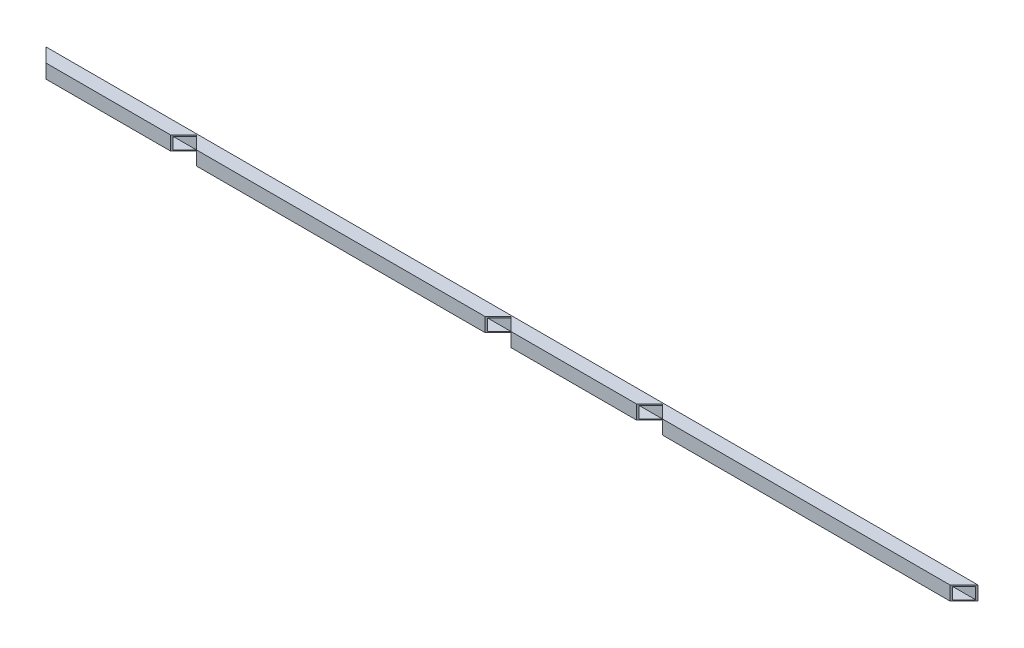
ISO-10303-21;
HEADER;
FILE_DESCRIPTION(('STEP AP214'),'2;1');
FILE_NAME('part.step','',(''),(''),'','','');
FILE_SCHEMA(('AUTOMOTIVE_DESIGN { 1 0 10303 214 1 1 1 1 }'));
ENDSEC;
DATA;
#1=APPLICATION_CONTEXT('core data for automotive mechanical design processes');
#2=APPLICATION_PROTOCOL_DEFINITION('international standard','automotive_design',2000,#1);
#3=PRODUCT_CONTEXT('',#1,'mechanical');
#4=PRODUCT('Part','Part','',(#3));
#5=PRODUCT_RELATED_PRODUCT_CATEGORY('part','',(#4));
#6=PRODUCT_DEFINITION_FORMATION('','',#4);
#7=PRODUCT_DEFINITION_CONTEXT('part definition',#1,'design');
#8=PRODUCT_DEFINITION('design','',#6,#7);
#9=PRODUCT_DEFINITION_SHAPE('','',#8);
#10=(LENGTH_UNIT() NAMED_UNIT(*) SI_UNIT(.MILLI.,.METRE.));
#11=(NAMED_UNIT(*) PLANE_ANGLE_UNIT() SI_UNIT($,.RADIAN.));
#12=(NAMED_UNIT(*) SI_UNIT($,.STERADIAN.) SOLID_ANGLE_UNIT());
#13=UNCERTAINTY_MEASURE_WITH_UNIT(LENGTH_MEASURE(1.E-05),#10,'distance_accuracy_value','');
#14=(GEOMETRIC_REPRESENTATION_CONTEXT(3) GLOBAL_UNCERTAINTY_ASSIGNED_CONTEXT((#13)) GLOBAL_UNIT_ASSIGNED_CONTEXT((#10,
#11,#12)) REPRESENTATION_CONTEXT('',''));
#15=CARTESIAN_POINT('',(0.,0.,0.));
#16=DIRECTION('',(0.,0.,1.));
#17=DIRECTION('',(1.,0.,0.));
#18=AXIS2_PLACEMENT_3D('',#15,#16,#17);
#19=CARTESIAN_POINT('',(-400.,-1.,-5.00000000000001));
#20=DIRECTION('',(0.,0.,-1.));
#21=DIRECTION('',(0.,1.,0.));
#22=AXIS2_PLACEMENT_3D('',#19,#20,#21);
#23=PLANE('',#22);
#24=DIRECTION('',(0.,-1.,0.));
#25=VECTOR('',#24,1.);
#26=CARTESIAN_POINT('',(130.,-1.00000000000005,-5.00000000000001));
#27=LINE('',#26,#25);
#28=CARTESIAN_POINT('',(130.,-1.,-5.));
#29=VERTEX_POINT('',#28);
#30=CARTESIAN_POINT('',(130.,-11.,-5.00000000000001));
#31=VERTEX_POINT('',#30);
#32=EDGE_CURVE('E11',#29,#31,#27,.T.);
#33=ORIENTED_EDGE('',*,*,#32,.F.);
#34=DIRECTION('',(1.,0.,0.));
#35=VECTOR('',#34,1.);
#36=CARTESIAN_POINT('',(-400.,-1.,-5.00000000000001));
#37=LINE('',#36,#35);
#38=CARTESIAN_POINT('',(0.,-1.,-5.));
#39=VERTEX_POINT('',#38);
#40=EDGE_CURVE('E293',#39,#29,#37,.T.);
#41=ORIENTED_EDGE('',*,*,#40,.F.);
#42=DIRECTION('',(0.,-1.,0.));
#43=VECTOR('',#42,1.);
#44=CARTESIAN_POINT('',(0.,-1.00000000000003,-5.00000000000001));
#45=LINE('',#44,#43);
#46=CARTESIAN_POINT('',(0.,-11.,-5.00000000000001));
#47=VERTEX_POINT('',#46);
#48=EDGE_CURVE('E45',#39,#47,#45,.T.);
#49=ORIENTED_EDGE('',*,*,#48,.T.);
#50=DIRECTION('',(1.,0.,0.));
#51=VECTOR('',#50,1.);
#52=CARTESIAN_POINT('',(-400.,-11.,-5.00000000000001));
#53=LINE('',#52,#51);
#54=EDGE_CURVE('E291',#47,#31,#53,.T.);
#55=ORIENTED_EDGE('',*,*,#54,.T.);
#56=EDGE_LOOP('',(#33,#41,#49,#55));
#57=FACE_BOUND('',#56,.T.);
#58=ADVANCED_FACE('F37',(#57),#23,.F.);
#59=ORIENTED_EDGE('',*,*,#48,.F.);
#60=CARTESIAN_POINT('',(-270.,-1.,-5.00000000000001));
#61=VERTEX_POINT('',#60);
#62=EDGE_CURVE('E487',#61,#39,#37,.T.);
#63=ORIENTED_EDGE('',*,*,#62,.F.);
#64=DIRECTION('',(0.,1.,0.));
#65=VECTOR('',#64,1.);
#66=CARTESIAN_POINT('',(-270.,-0.999999999999989,-5.00000000000001));
#67=LINE('',#66,#65);
#68=CARTESIAN_POINT('',(-270.,-11.,-5.00000000000001));
#69=VERTEX_POINT('',#68);
#70=EDGE_CURVE('E281',#69,#61,#67,.T.);
#71=ORIENTED_EDGE('',*,*,#70,.F.);
#72=EDGE_CURVE('E304',#69,#47,#53,.T.);
#73=ORIENTED_EDGE('',*,*,#72,.T.);
#74=EDGE_LOOP('',(#59,#63,#71,#73));
#75=FACE_BOUND('',#74,.T.);
#76=ADVANCED_FACE('F324',(#75),#23,.F.);
#77=CARTESIAN_POINT('',(399.,-1.,-5.));
#78=VERTEX_POINT('',#77);
#79=EDGE_CURVE('E343',#29,#78,#37,.T.);
#80=ORIENTED_EDGE('',*,*,#79,.F.);
#81=ORIENTED_EDGE('',*,*,#32,.T.);
#82=CARTESIAN_POINT('',(399.,-11.,-5.));
#83=VERTEX_POINT('',#82);
#84=EDGE_CURVE('E321',#31,#83,#53,.T.);
#85=ORIENTED_EDGE('',*,*,#84,.T.);
#86=DIRECTION('',(0.,1.,0.));
#87=VECTOR('',#86,1.);
#88=CARTESIAN_POINT('',(399.,-0.999999999999931,-5.00000000000001));
#89=LINE('',#88,#87);
#90=EDGE_CURVE('E412',#83,#78,#89,.T.);
#91=ORIENTED_EDGE('',*,*,#90,.T.);
#92=EDGE_LOOP('',(#80,#81,#85,#91));
#93=FACE_BOUND('',#92,.T.);
#94=ADVANCED_FACE('F518',(#93),#23,.F.);
#95=CARTESIAN_POINT('',(-400.,-11.,5.));
#96=DIRECTION('',(0.,-1.,0.));
#97=DIRECTION('',(0.,0.,-1.));
#98=AXIS2_PLACEMENT_3D('',#95,#96,#97);
#99=PLANE('',#98);
#100=DIRECTION('',(1.,0.,0.));
#101=VECTOR('',#100,1.);
#102=CARTESIAN_POINT('',(-400.,-11.,5.));
#103=LINE('',#102,#101);
#104=CARTESIAN_POINT('',(10.,-11.,5.));
#105=VERTEX_POINT('',#104);
#106=CARTESIAN_POINT('',(120.,-11.,5.));
#107=VERTEX_POINT('',#106);
#108=EDGE_CURVE('E336',#105,#107,#103,.T.);
#109=ORIENTED_EDGE('',*,*,#108,.T.);
#110=DIRECTION('',(0.707106781186546,0.,-0.707106781186549));
#111=VECTOR('',#110,1.);
#112=CARTESIAN_POINT('',(-139.999999999999,-11.,265.));
#113=LINE('',#112,#111);
#114=EDGE_CURVE('E319',#107,#31,#113,.T.);
#115=ORIENTED_EDGE('',*,*,#114,.T.);
#116=ORIENTED_EDGE('',*,*,#54,.F.);
#117=DIRECTION('',(0.707106781186548,0.,0.707106781186547));
#118=VECTOR('',#117,1.);
#119=CARTESIAN_POINT('',(-195.,-11.,-200.));
#120=LINE('',#119,#118);
#121=EDGE_CURVE('E317',#47,#105,#120,.T.);
#122=ORIENTED_EDGE('',*,*,#121,.T.);
#123=EDGE_LOOP('',(#109,#115,#116,#122));
#124=FACE_BOUND('',#123,.T.);
#125=ADVANCED_FACE('F316',(#124),#99,.F.);
#126=CARTESIAN_POINT('',(-260.,-11.,5.));
#127=VERTEX_POINT('',#126);
#128=CARTESIAN_POINT('',(-9.9999999999999,-11.,5.));
#129=VERTEX_POINT('',#128);
#130=EDGE_CURVE('E307',#127,#129,#103,.T.);
#131=ORIENTED_EDGE('',*,*,#130,.T.);
#132=DIRECTION('',(0.707106781186546,0.,-0.707106781186549));
#133=VECTOR('',#132,1.);
#134=CARTESIAN_POINT('',(-204.999999999999,-11.,200.));
#135=LINE('',#134,#133);
#136=EDGE_CURVE('E301',#129,#47,#135,.T.);
#137=ORIENTED_EDGE('',*,*,#136,.T.);
#138=ORIENTED_EDGE('',*,*,#72,.F.);
#139=DIRECTION('',(0.707106781186548,0.,0.707106781186547));
#140=VECTOR('',#139,1.);
#141=CARTESIAN_POINT('',(-330.,-11.,-65.));
#142=LINE('',#141,#140);
#143=EDGE_CURVE('E379',#69,#127,#142,.T.);
#144=ORIENTED_EDGE('',*,*,#143,.T.);
#145=EDGE_LOOP('',(#131,#137,#138,#144));
#146=FACE_BOUND('',#145,.T.);
#147=ADVANCED_FACE('F302',(#146),#99,.F.);
#148=ORIENTED_EDGE('',*,*,#84,.F.);
#149=DIRECTION('',(0.707106781186548,0.,0.707106781186547));
#150=VECTOR('',#149,1.);
#151=CARTESIAN_POINT('',(-130.,-11.,-265.));
#152=LINE('',#151,#150);
#153=CARTESIAN_POINT('',(140.,-11.,5.));
#154=VERTEX_POINT('',#153);
#155=EDGE_CURVE('E421',#31,#154,#152,.T.);
#156=ORIENTED_EDGE('',*,*,#155,.T.);
#157=CARTESIAN_POINT('',(389.,-11.,5.));
#158=VERTEX_POINT('',#157);
#159=EDGE_CURVE('E333',#154,#158,#103,.T.);
#160=ORIENTED_EDGE('',*,*,#159,.T.);
#161=DIRECTION('',(0.707106781186541,0.,-0.707106781186554));
#162=VECTOR('',#161,1.);
#163=CARTESIAN_POINT('',(-5.49999999999295,-11.,399.5));
#164=LINE('',#163,#162);
#165=EDGE_CURVE('E409',#158,#83,#164,.T.);
#166=ORIENTED_EDGE('',*,*,#165,.T.);
#167=EDGE_LOOP('',(#148,#156,#160,#166));
#168=FACE_BOUND('',#167,.T.);
#169=ADVANCED_FACE('F510',(#168),#99,.F.);
#170=CARTESIAN_POINT('',(-400.,-1.,5.));
#171=DIRECTION('',(0.,0.,1.));
#172=DIRECTION('',(0.,-1.,0.));
#173=AXIS2_PLACEMENT_3D('',#170,#171,#172);
#174=PLANE('',#173);
#175=DIRECTION('',(1.,0.,0.));
#176=VECTOR('',#175,1.);
#177=CARTESIAN_POINT('',(-400.,-1.,5.));
#178=LINE('',#177,#176);
#179=CARTESIAN_POINT('',(9.99999999999998,-1.,4.99999999999998));
#180=VERTEX_POINT('',#179);
#181=CARTESIAN_POINT('',(120.,-1.,4.99999999999995));
#182=VERTEX_POINT('',#181);
#183=EDGE_CURVE('E341',#180,#182,#178,.T.);
#184=ORIENTED_EDGE('',*,*,#183,.T.);
#185=DIRECTION('',(0.,-1.,0.));
#186=VECTOR('',#185,1.);
#187=CARTESIAN_POINT('',(120.,-0.999999999999955,5.));
#188=LINE('',#187,#186);
#189=EDGE_CURVE('E426',#182,#107,#188,.T.);
#190=ORIENTED_EDGE('',*,*,#189,.T.);
#191=ORIENTED_EDGE('',*,*,#108,.F.);
#192=DIRECTION('',(0.,1.,0.));
#193=VECTOR('',#192,1.);
#194=CARTESIAN_POINT('',(10.,-1.00000000000004,5.));
#195=LINE('',#194,#193);
#196=EDGE_CURVE('E387',#105,#180,#195,.T.);
#197=ORIENTED_EDGE('',*,*,#196,.T.);
#198=EDGE_LOOP('',(#184,#190,#191,#197));
#199=FACE_BOUND('',#198,.T.);
#200=ADVANCED_FACE('F481',(#199),#174,.F.);
#201=CARTESIAN_POINT('',(-260.,-1.,4.99999999999999));
#202=VERTEX_POINT('',#201);
#203=CARTESIAN_POINT('',(-9.99999999999984,-1.,5.));
#204=VERTEX_POINT('',#203);
#205=EDGE_CURVE('E498',#202,#204,#178,.T.);
#206=ORIENTED_EDGE('',*,*,#205,.T.);
#207=DIRECTION('',(0.,-1.,0.));
#208=VECTOR('',#207,1.);
#209=CARTESIAN_POINT('',(-9.9999999999999,-0.999999999999966,5.));
#210=LINE('',#209,#208);
#211=EDGE_CURVE('E310',#204,#129,#210,.T.);
#212=ORIENTED_EDGE('',*,*,#211,.T.);
#213=ORIENTED_EDGE('',*,*,#130,.F.);
#214=DIRECTION('',(0.,1.,0.));
#215=VECTOR('',#214,1.);
#216=CARTESIAN_POINT('',(-260.,-1.00000000000001,5.));
#217=LINE('',#216,#215);
#218=EDGE_CURVE('E375',#127,#202,#217,.T.);
#219=ORIENTED_EDGE('',*,*,#218,.T.);
#220=EDGE_LOOP('',(#206,#212,#213,#219));
#221=FACE_BOUND('',#220,.T.);
#222=ADVANCED_FACE('F501',(#221),#174,.F.);
#223=ORIENTED_EDGE('',*,*,#159,.F.);
#224=DIRECTION('',(0.,1.,0.));
#225=VECTOR('',#224,1.);
#226=CARTESIAN_POINT('',(140.,-1.00000000000005,5.));
#227=LINE('',#226,#225);
#228=CARTESIAN_POINT('',(140.,-1.,4.99999999999995));
#229=VERTEX_POINT('',#228);
#230=EDGE_CURVE('E418',#154,#229,#227,.T.);
#231=ORIENTED_EDGE('',*,*,#230,.T.);
#232=CARTESIAN_POINT('',(389.,-1.,4.99999999999997));
#233=VERTEX_POINT('',#232);
#234=EDGE_CURVE('E338',#229,#233,#178,.T.);
#235=ORIENTED_EDGE('',*,*,#234,.T.);
#236=DIRECTION('',(0.,-1.,0.));
#237=VECTOR('',#236,1.);
#238=CARTESIAN_POINT('',(389.,-0.999999999999931,5.));
#239=LINE('',#238,#237);
#240=EDGE_CURVE('E406',#233,#158,#239,.T.);
#241=ORIENTED_EDGE('',*,*,#240,.T.);
#242=EDGE_LOOP('',(#223,#231,#235,#241));
#243=FACE_BOUND('',#242,.T.);
#244=ADVANCED_FACE('F503',(#243),#174,.F.);
#245=CARTESIAN_POINT('',(-400.,-1.,5.));
#246=DIRECTION('',(0.,1.,0.));
#247=DIRECTION('',(0.,0.,1.));
#248=AXIS2_PLACEMENT_3D('',#245,#246,#247);
#249=PLANE('',#248);
#250=ORIENTED_EDGE('',*,*,#40,.T.);
#251=DIRECTION('',(-0.707106781186546,0.,0.707106781186549));
#252=VECTOR('',#251,1.);
#253=CARTESIAN_POINT('',(-139.999999999999,-1.,265.));
#254=LINE('',#253,#252);
#255=EDGE_CURVE('E278',#29,#182,#254,.T.);
#256=ORIENTED_EDGE('',*,*,#255,.T.);
#257=ORIENTED_EDGE('',*,*,#183,.F.);
#258=DIRECTION('',(-0.707106781186548,0.,-0.707106781186547));
#259=VECTOR('',#258,1.);
#260=CARTESIAN_POINT('',(-195.,-1.,-200.));
#261=LINE('',#260,#259);
#262=EDGE_CURVE('E263',#180,#39,#261,.T.);
#263=ORIENTED_EDGE('',*,*,#262,.T.);
#264=EDGE_LOOP('',(#250,#256,#257,#263));
#265=FACE_BOUND('',#264,.T.);
#266=ADVANCED_FACE('F486',(#265),#249,.F.);
#267=ORIENTED_EDGE('',*,*,#62,.T.);
#268=DIRECTION('',(-0.707106781186546,0.,0.707106781186549));
#269=VECTOR('',#268,1.);
#270=CARTESIAN_POINT('',(-204.999999999999,-1.,200.));
#271=LINE('',#270,#269);
#272=EDGE_CURVE('E266',#39,#204,#271,.T.);
#273=ORIENTED_EDGE('',*,*,#272,.T.);
#274=ORIENTED_EDGE('',*,*,#205,.F.);
#275=DIRECTION('',(-0.707106781186548,0.,-0.707106781186547));
#276=VECTOR('',#275,1.);
#277=CARTESIAN_POINT('',(-330.,-1.,-65.));
#278=LINE('',#277,#276);
#279=EDGE_CURVE('E260',#202,#61,#278,.T.);
#280=ORIENTED_EDGE('',*,*,#279,.T.);
#281=EDGE_LOOP('',(#267,#273,#274,#280));
#282=FACE_BOUND('',#281,.T.);
#283=ADVANCED_FACE('F496',(#282),#249,.F.);
#284=ORIENTED_EDGE('',*,*,#234,.F.);
#285=DIRECTION('',(-0.707106781186548,0.,-0.707106781186547));
#286=VECTOR('',#285,1.);
#287=CARTESIAN_POINT('',(-130.,-1.,-265.));
#288=LINE('',#287,#286);
#289=EDGE_CURVE('E275',#229,#29,#288,.T.);
#290=ORIENTED_EDGE('',*,*,#289,.T.);
#291=ORIENTED_EDGE('',*,*,#79,.T.);
#292=DIRECTION('',(-0.707106781186541,0.,0.707106781186554));
#293=VECTOR('',#292,1.);
#294=CARTESIAN_POINT('',(-5.49999999999295,-1.,399.5));
#295=LINE('',#294,#293);
#296=EDGE_CURVE('E272',#78,#233,#295,.T.);
#297=ORIENTED_EDGE('',*,*,#296,.T.);
#298=EDGE_LOOP('',(#284,#290,#291,#297));
#299=FACE_BOUND('',#298,.T.);
#300=ADVANCED_FACE('F521',(#299),#249,.F.);
#301=CARTESIAN_POINT('',(-399.,-1.,-5.00000000000001));
#302=VERTEX_POINT('',#301);
#303=EDGE_CURVE('E342',#302,#61,#37,.T.);
#304=ORIENTED_EDGE('',*,*,#303,.F.);
#305=DIRECTION('',(0.,-1.,0.));
#306=VECTOR('',#305,1.);
#307=CARTESIAN_POINT('',(-399.,-1.,-5.00000000000001));
#308=LINE('',#307,#306);
#309=CARTESIAN_POINT('',(-399.,-11.,-5.00000000000001));
#310=VERTEX_POINT('',#309);
#311=EDGE_CURVE('E402',#302,#310,#308,.T.);
#312=ORIENTED_EDGE('',*,*,#311,.T.);
#313=EDGE_CURVE('E326',#310,#69,#53,.T.);
#314=ORIENTED_EDGE('',*,*,#313,.T.);
#315=ORIENTED_EDGE('',*,*,#70,.T.);
#316=EDGE_LOOP('',(#304,#312,#314,#315));
#317=FACE_BOUND('',#316,.T.);
#318=ADVANCED_FACE('F494',(#317),#23,.F.);
#319=ORIENTED_EDGE('',*,*,#313,.F.);
#320=DIRECTION('',(0.707106781186556,0.,0.707106781186539));
#321=VECTOR('',#320,1.);
#322=CARTESIAN_POINT('',(-394.5,-11.,-0.500000000000134));
#323=LINE('',#322,#321);
#324=CARTESIAN_POINT('',(-389.,-11.,5.));
#325=VERTEX_POINT('',#324);
#326=EDGE_CURVE('E399',#310,#325,#323,.T.);
#327=ORIENTED_EDGE('',*,*,#326,.T.);
#328=CARTESIAN_POINT('',(-280.,-11.,5.));
#329=VERTEX_POINT('',#328);
#330=EDGE_CURVE('E330',#325,#329,#103,.T.);
#331=ORIENTED_EDGE('',*,*,#330,.T.);
#332=DIRECTION('',(0.707106781186546,0.,-0.707106781186549));
#333=VECTOR('',#332,1.);
#334=CARTESIAN_POINT('',(-340.,-11.,65.));
#335=LINE('',#334,#333);
#336=EDGE_CURVE('E376',#329,#69,#335,.T.);
#337=ORIENTED_EDGE('',*,*,#336,.T.);
#338=EDGE_LOOP('',(#319,#327,#331,#337));
#339=FACE_BOUND('',#338,.T.);
#340=ADVANCED_FACE('F478',(#339),#99,.F.);
#341=ORIENTED_EDGE('',*,*,#330,.F.);
#342=DIRECTION('',(0.,1.,0.));
#343=VECTOR('',#342,1.);
#344=CARTESIAN_POINT('',(-389.,-1.,5.));
#345=LINE('',#344,#343);
#346=CARTESIAN_POINT('',(-389.,-1.,5.));
#347=VERTEX_POINT('',#346);
#348=EDGE_CURVE('E396',#325,#347,#345,.T.);
#349=ORIENTED_EDGE('',*,*,#348,.T.);
#350=CARTESIAN_POINT('',(-280.,-1.,5.));
#351=VERTEX_POINT('',#350);
#352=EDGE_CURVE('E337',#347,#351,#178,.T.);
#353=ORIENTED_EDGE('',*,*,#352,.T.);
#354=DIRECTION('',(0.,-1.,0.));
#355=VECTOR('',#354,1.);
#356=CARTESIAN_POINT('',(-280.,-0.99999999999999,5.));
#357=LINE('',#356,#355);
#358=EDGE_CURVE('E381',#351,#329,#357,.T.);
#359=ORIENTED_EDGE('',*,*,#358,.T.);
#360=EDGE_LOOP('',(#341,#349,#353,#359));
#361=FACE_BOUND('',#360,.T.);
#362=ADVANCED_FACE('F474',(#361),#174,.F.);
#363=ORIENTED_EDGE('',*,*,#352,.F.);
#364=DIRECTION('',(-0.707106781186556,0.,-0.707106781186539));
#365=VECTOR('',#364,1.);
#366=CARTESIAN_POINT('',(-394.5,-1.,-0.500000000000133));
#367=LINE('',#366,#365);
#368=EDGE_CURVE('E269',#347,#302,#367,.T.);
#369=ORIENTED_EDGE('',*,*,#368,.T.);
#370=ORIENTED_EDGE('',*,*,#303,.T.);
#371=DIRECTION('',(-0.707106781186546,0.,0.707106781186549));
#372=VECTOR('',#371,1.);
#373=CARTESIAN_POINT('',(-340.,-1.,65.));
#374=LINE('',#373,#372);
#375=EDGE_CURVE('E254',#61,#351,#374,.T.);
#376=ORIENTED_EDGE('',*,*,#375,.T.);
#377=EDGE_LOOP('',(#363,#369,#370,#376));
#378=FACE_BOUND('',#377,.T.);
#379=ADVANCED_FACE('F492',(#378),#249,.F.);
#380=CARTESIAN_POINT('',(-259.,-72.,6.));
#381=DIRECTION('',(0.707106781186547,0.,-0.707106781186548));
#382=DIRECTION('',(-0.707106781186548,0.,-0.707106781186547));
#383=AXIS2_PLACEMENT_3D('',#380,#381,#382);
#384=PLANE('',#383);
#385=DIRECTION('',(0.,1.,0.));
#386=VECTOR('',#385,1.);
#387=CARTESIAN_POINT('',(-259.,-72.,6.));
#388=LINE('',#387,#386);
#389=CARTESIAN_POINT('',(-259.,-12.,6.));
#390=VERTEX_POINT('',#389);
#391=CARTESIAN_POINT('',(-259.,0.,6.));
#392=VERTEX_POINT('',#391);
#393=EDGE_CURVE('E465',#390,#392,#388,.T.);
#394=ORIENTED_EDGE('',*,*,#393,.T.);
#395=DIRECTION('',(-0.707106781186548,0.,-0.707106781186547));
#396=VECTOR('',#395,1.);
#397=CARTESIAN_POINT('',(-259.,0.,6.));
#398=LINE('',#397,#396);
#399=CARTESIAN_POINT('',(-270.,0.,-4.99999999999995));
#400=VERTEX_POINT('',#399);
#401=EDGE_CURVE('E52',#392,#400,#398,.T.);
#402=ORIENTED_EDGE('',*,*,#401,.T.);
#403=DIRECTION('',(0.,1.,0.));
#404=VECTOR('',#403,1.);
#405=CARTESIAN_POINT('',(-270.,-72.,-5.00000000000001));
#406=LINE('',#405,#404);
#407=EDGE_CURVE('E464',#61,#400,#406,.T.);
#408=ORIENTED_EDGE('',*,*,#407,.F.);
#409=ORIENTED_EDGE('',*,*,#279,.F.);
#410=ORIENTED_EDGE('',*,*,#218,.F.);
#411=ORIENTED_EDGE('',*,*,#143,.F.);
#412=CARTESIAN_POINT('',(-270.,-12.,-5.00000000000001));
#413=VERTEX_POINT('',#412);
#414=EDGE_CURVE('E468',#413,#69,#406,.T.);
#415=ORIENTED_EDGE('',*,*,#414,.F.);
#416=DIRECTION('',(-0.707106781186548,0.,-0.707106781186547));
#417=VECTOR('',#416,1.);
#418=CARTESIAN_POINT('',(-132.5,-12.,132.5));
#419=LINE('',#418,#417);
#420=EDGE_CURVE('E371',#390,#413,#419,.T.);
#421=ORIENTED_EDGE('',*,*,#420,.F.);
#422=EDGE_LOOP('',(#394,#402,#408,#409,#410,#411,#415,#421));
#423=FACE_BOUND('',#422,.T.);
#424=ADVANCED_FACE('F499',(#423),#384,.F.);
#425=CARTESIAN_POINT('',(-270.,-72.,-5.00000000000001));
#426=DIRECTION('',(-0.707106781186549,0.,-0.707106781186546));
#427=DIRECTION('',(-0.707106781186546,0.,0.707106781186549));
#428=AXIS2_PLACEMENT_3D('',#425,#426,#427);
#429=PLANE('',#428);
#430=ORIENTED_EDGE('',*,*,#414,.T.);
#431=ORIENTED_EDGE('',*,*,#336,.F.);
#432=ORIENTED_EDGE('',*,*,#358,.F.);
#433=ORIENTED_EDGE('',*,*,#375,.F.);
#434=ORIENTED_EDGE('',*,*,#407,.T.);
#435=DIRECTION('',(-0.707106781186546,0.,0.707106781186549));
#436=VECTOR('',#435,1.);
#437=CARTESIAN_POINT('',(-270.,0.,-5.00000000000001));
#438=LINE('',#437,#436);
#439=CARTESIAN_POINT('',(-281.,0.,6.));
#440=VERTEX_POINT('',#439);
#441=EDGE_CURVE('E462',#400,#440,#438,.T.);
#442=ORIENTED_EDGE('',*,*,#441,.T.);
#443=DIRECTION('',(0.,1.,0.));
#444=VECTOR('',#443,1.);
#445=CARTESIAN_POINT('',(-281.,-72.,6.));
#446=LINE('',#445,#444);
#447=CARTESIAN_POINT('',(-281.,-12.,6.));
#448=VERTEX_POINT('',#447);
#449=EDGE_CURVE('E361',#448,#440,#446,.T.);
#450=ORIENTED_EDGE('',*,*,#449,.F.);
#451=DIRECTION('',(-0.707106781186546,0.,0.707106781186549));
#452=VECTOR('',#451,1.);
#453=CARTESIAN_POINT('',(-137.500000000001,-12.,-137.5));
#454=LINE('',#453,#452);
#455=EDGE_CURVE('E370',#413,#448,#454,.T.);
#456=ORIENTED_EDGE('',*,*,#455,.F.);
#457=EDGE_LOOP('',(#430,#431,#432,#433,#434,#442,#450,#456));
#458=FACE_BOUND('',#457,.T.);
#459=ADVANCED_FACE('F558',(#458),#429,.F.);
#460=CARTESIAN_POINT('',(0.,-72.,-5.00000000000001));
#461=DIRECTION('',(-0.707106781186549,0.,-0.707106781186546));
#462=DIRECTION('',(-0.707106781186546,0.,0.707106781186549));
#463=AXIS2_PLACEMENT_3D('',#460,#461,#462);
#464=PLANE('',#463);
#465=DIRECTION('',(0.,1.,0.));
#466=VECTOR('',#465,1.);
#467=CARTESIAN_POINT('',(0.,-72.,-5.00000000000001));
#468=LINE('',#467,#466);
#469=CARTESIAN_POINT('',(0.,-12.,-5.00000000000001));
#470=VERTEX_POINT('',#469);
#471=EDGE_CURVE('E441',#470,#47,#468,.T.);
#472=ORIENTED_EDGE('',*,*,#471,.T.);
#473=ORIENTED_EDGE('',*,*,#136,.F.);
#474=ORIENTED_EDGE('',*,*,#211,.F.);
#475=ORIENTED_EDGE('',*,*,#272,.F.);
#476=CARTESIAN_POINT('',(0.,0.,-5.00000000000001));
#477=VERTEX_POINT('',#476);
#478=EDGE_CURVE('E218',#39,#477,#468,.T.);
#479=ORIENTED_EDGE('',*,*,#478,.T.);
#480=DIRECTION('',(-0.707106781186546,0.,0.707106781186549));
#481=VECTOR('',#480,1.);
#482=CARTESIAN_POINT('',(0.,0.,-5.00000000000001));
#483=LINE('',#482,#481);
#484=CARTESIAN_POINT('',(-10.9999999999999,0.,6.));
#485=VERTEX_POINT('',#484);
#486=EDGE_CURVE('E211',#477,#485,#483,.T.);
#487=ORIENTED_EDGE('',*,*,#486,.T.);
#488=DIRECTION('',(0.,1.,0.));
#489=VECTOR('',#488,1.);
#490=CARTESIAN_POINT('',(-10.9999999999999,-72.,6.));
#491=LINE('',#490,#489);
#492=CARTESIAN_POINT('',(-10.9999999999999,-12.,6.));
#493=VERTEX_POINT('',#492);
#494=EDGE_CURVE('E215',#493,#485,#491,.T.);
#495=ORIENTED_EDGE('',*,*,#494,.F.);
#496=DIRECTION('',(-0.707106781186546,0.,0.707106781186549));
#497=VECTOR('',#496,1.);
#498=CARTESIAN_POINT('',(-2.49999999999997,-12.,-2.49999999999996));
#499=LINE('',#498,#497);
#500=EDGE_CURVE('E309',#470,#493,#499,.T.);
#501=ORIENTED_EDGE('',*,*,#500,.F.);
#502=EDGE_LOOP('',(#472,#473,#474,#475,#479,#487,#495,#501));
#503=FACE_BOUND('',#502,.T.);
#504=ADVANCED_FACE('F214',(#503),#464,.F.);
#505=CARTESIAN_POINT('',(11.0000000000001,-72.,6.));
#506=DIRECTION('',(0.707106781186547,0.,-0.707106781186548));
#507=DIRECTION('',(-0.707106781186548,0.,-0.707106781186547));
#508=AXIS2_PLACEMENT_3D('',#505,#506,#507);
#509=PLANE('',#508);
#510=DIRECTION('',(0.,1.,0.));
#511=VECTOR('',#510,1.);
#512=CARTESIAN_POINT('',(11.0000000000001,-72.,6.));
#513=LINE('',#512,#511);
#514=CARTESIAN_POINT('',(11.0000000000001,-12.,6.));
#515=VERTEX_POINT('',#514);
#516=CARTESIAN_POINT('',(11.0000000000001,0.,6.));
#517=VERTEX_POINT('',#516);
#518=EDGE_CURVE('E234',#515,#517,#513,.T.);
#519=ORIENTED_EDGE('',*,*,#518,.T.);
#520=DIRECTION('',(-0.707106781186548,0.,-0.707106781186547));
#521=VECTOR('',#520,1.);
#522=CARTESIAN_POINT('',(11.0000000000001,0.,6.));
#523=LINE('',#522,#521);
#524=EDGE_CURVE('E223',#517,#477,#523,.T.);
#525=ORIENTED_EDGE('',*,*,#524,.T.);
#526=ORIENTED_EDGE('',*,*,#478,.F.);
#527=ORIENTED_EDGE('',*,*,#262,.F.);
#528=ORIENTED_EDGE('',*,*,#196,.F.);
#529=ORIENTED_EDGE('',*,*,#121,.F.);
#530=ORIENTED_EDGE('',*,*,#471,.F.);
#531=DIRECTION('',(-0.707106781186548,0.,-0.707106781186547));
#532=VECTOR('',#531,1.);
#533=CARTESIAN_POINT('',(2.50000000000003,-12.,-2.50000000000003));
#534=LINE('',#533,#532);
#535=EDGE_CURVE('E391',#515,#470,#534,.T.);
#536=ORIENTED_EDGE('',*,*,#535,.F.);
#537=EDGE_LOOP('',(#519,#525,#526,#527,#528,#529,#530,#536));
#538=FACE_BOUND('',#537,.T.);
#539=ADVANCED_FACE('F547',(#538),#509,.F.);
#540=CARTESIAN_POINT('',(-400.,-72.,-6.00000000000001));
#541=DIRECTION('',(0.707106781186539,0.,-0.707106781186556));
#542=DIRECTION('',(-0.707106781186556,0.,-0.707106781186539));
#543=AXIS2_PLACEMENT_3D('',#540,#541,#542);
#544=PLANE('',#543);
#545=ORIENTED_EDGE('',*,*,#368,.F.);
#546=ORIENTED_EDGE('',*,*,#348,.F.);
#547=ORIENTED_EDGE('',*,*,#326,.F.);
#548=ORIENTED_EDGE('',*,*,#311,.F.);
#549=EDGE_LOOP('',(#545,#546,#547,#548));
#550=FACE_BOUND('',#549,.T.);
#551=DIRECTION('',(0.,1.,0.));
#552=VECTOR('',#551,1.);
#553=CARTESIAN_POINT('',(-388.,-72.,6.));
#554=LINE('',#553,#552);
#555=CARTESIAN_POINT('',(-388.,-12.,6.));
#556=VERTEX_POINT('',#555);
#557=CARTESIAN_POINT('',(-388.,0.,6.));
#558=VERTEX_POINT('',#557);
#559=EDGE_CURVE('E224',#556,#558,#554,.T.);
#560=ORIENTED_EDGE('',*,*,#559,.T.);
#561=DIRECTION('',(-0.707106781186556,0.,-0.707106781186539));
#562=VECTOR('',#561,1.);
#563=CARTESIAN_POINT('',(-400.,0.,-6.00000000000001));
#564=LINE('',#563,#562);
#565=CARTESIAN_POINT('',(-400.,0.,-6.00000000000001));
#566=VERTEX_POINT('',#565);
#567=EDGE_CURVE('E445',#558,#566,#564,.T.);
#568=ORIENTED_EDGE('',*,*,#567,.T.);
#569=DIRECTION('',(0.,1.,0.));
#570=VECTOR('',#569,1.);
#571=CARTESIAN_POINT('',(-400.,-12.,-6.00000000000001));
#572=LINE('',#571,#570);
#573=CARTESIAN_POINT('',(-400.,-12.,-6.00000000000001));
#574=VERTEX_POINT('',#573);
#575=EDGE_CURVE('E251',#574,#566,#572,.T.);
#576=ORIENTED_EDGE('',*,*,#575,.F.);
#577=DIRECTION('',(-0.707106781186556,0.,-0.707106781186539));
#578=VECTOR('',#577,1.);
#579=CARTESIAN_POINT('',(-196.999999999995,-12.,197.));
#580=LINE('',#579,#578);
#581=EDGE_CURVE('E368',#556,#574,#580,.T.);
#582=ORIENTED_EDGE('',*,*,#581,.F.);
#583=EDGE_LOOP('',(#560,#568,#576,#582));
#584=FACE_BOUND('',#583,.T.);
#585=ADVANCED_FACE('F550',(#550,#584),#544,.F.);
#586=CARTESIAN_POINT('',(400.,-72.,-6.00000000000001));
#587=DIRECTION('',(-0.707106781186554,0.,-0.707106781186541));
#588=DIRECTION('',(-0.707106781186541,0.,0.707106781186554));
#589=AXIS2_PLACEMENT_3D('',#586,#587,#588);
#590=PLANE('',#589);
#591=ORIENTED_EDGE('',*,*,#165,.F.);
#592=ORIENTED_EDGE('',*,*,#240,.F.);
#593=ORIENTED_EDGE('',*,*,#296,.F.);
#594=ORIENTED_EDGE('',*,*,#90,.F.);
#595=EDGE_LOOP('',(#591,#592,#593,#594));
#596=FACE_BOUND('',#595,.T.);
#597=DIRECTION('',(0.,1.,0.));
#598=VECTOR('',#597,1.);
#599=CARTESIAN_POINT('',(400.,-12.,-6.00000000000001));
#600=LINE('',#599,#598);
#601=CARTESIAN_POINT('',(400.,-12.,-6.00000000000001));
#602=VERTEX_POINT('',#601);
#603=CARTESIAN_POINT('',(400.,0.,-6.00000000000001));
#604=VERTEX_POINT('',#603);
#605=EDGE_CURVE('E255',#602,#604,#600,.T.);
#606=ORIENTED_EDGE('',*,*,#605,.T.);
#607=DIRECTION('',(-0.707106781186541,0.,0.707106781186554));
#608=VECTOR('',#607,1.);
#609=CARTESIAN_POINT('',(400.,0.,-6.00000000000001));
#610=LINE('',#609,#608);
#611=CARTESIAN_POINT('',(388.,0.,5.99999999999999));
#612=VERTEX_POINT('',#611);
#613=EDGE_CURVE('E449',#604,#612,#610,.T.);
#614=ORIENTED_EDGE('',*,*,#613,.T.);
#615=DIRECTION('',(0.,1.,0.));
#616=VECTOR('',#615,1.);
#617=CARTESIAN_POINT('',(388.,-72.,5.99999999999999));
#618=LINE('',#617,#616);
#619=CARTESIAN_POINT('',(388.,-12.,5.99999999999999));
#620=VERTEX_POINT('',#619);
#621=EDGE_CURVE('E447',#620,#612,#618,.T.);
#622=ORIENTED_EDGE('',*,*,#621,.F.);
#623=DIRECTION('',(-0.707106781186541,0.,0.707106781186554));
#624=VECTOR('',#623,1.);
#625=CARTESIAN_POINT('',(197.000000000003,-12.,197.));
#626=LINE('',#625,#624);
#627=EDGE_CURVE('E415',#602,#620,#626,.T.);
#628=ORIENTED_EDGE('',*,*,#627,.F.);
#629=EDGE_LOOP('',(#606,#614,#622,#628));
#630=FACE_BOUND('',#629,.T.);
#631=ADVANCED_FACE('F541',(#596,#630),#590,.F.);
#632=CARTESIAN_POINT('',(130.,-72.,-5.00000000000001));
#633=DIRECTION('',(-0.707106781186549,0.,-0.707106781186546));
#634=DIRECTION('',(-0.707106781186546,0.,0.707106781186549));
#635=AXIS2_PLACEMENT_3D('',#632,#633,#634);
#636=PLANE('',#635);
#637=DIRECTION('',(0.,1.,0.));
#638=VECTOR('',#637,1.);
#639=CARTESIAN_POINT('',(130.,-72.,-5.00000000000001));
#640=LINE('',#639,#638);
#641=CARTESIAN_POINT('',(130.,-12.,-5.00000000000001));
#642=VERTEX_POINT('',#641);
#643=EDGE_CURVE('E451',#642,#31,#640,.T.);
#644=ORIENTED_EDGE('',*,*,#643,.T.);
#645=ORIENTED_EDGE('',*,*,#114,.F.);
#646=ORIENTED_EDGE('',*,*,#189,.F.);
#647=ORIENTED_EDGE('',*,*,#255,.F.);
#648=CARTESIAN_POINT('',(130.,0.,-5.00000000000001));
#649=VERTEX_POINT('',#648);
#650=EDGE_CURVE('E457',#29,#649,#640,.T.);
#651=ORIENTED_EDGE('',*,*,#650,.T.);
#652=DIRECTION('',(-0.707106781186546,0.,0.707106781186549));
#653=VECTOR('',#652,1.);
#654=CARTESIAN_POINT('',(130.,0.,-5.00000000000001));
#655=LINE('',#654,#653);
#656=CARTESIAN_POINT('',(119.,0.,6.));
#657=VERTEX_POINT('',#656);
#658=EDGE_CURVE('E453',#649,#657,#655,.T.);
#659=ORIENTED_EDGE('',*,*,#658,.T.);
#660=DIRECTION('',(0.,1.,0.));
#661=VECTOR('',#660,1.);
#662=CARTESIAN_POINT('',(119.,-72.,6.));
#663=LINE('',#662,#661);
#664=CARTESIAN_POINT('',(119.,-12.,6.));
#665=VERTEX_POINT('',#664);
#666=EDGE_CURVE('E438',#665,#657,#663,.T.);
#667=ORIENTED_EDGE('',*,*,#666,.F.);
#668=DIRECTION('',(-0.707106781186546,0.,0.707106781186549));
#669=VECTOR('',#668,1.);
#670=CARTESIAN_POINT('',(62.5000000000003,-12.,62.5));
#671=LINE('',#670,#669);
#672=EDGE_CURVE('E331',#642,#665,#671,.T.);
#673=ORIENTED_EDGE('',*,*,#672,.F.);
#674=EDGE_LOOP('',(#644,#645,#646,#647,#651,#659,#667,#673));
#675=FACE_BOUND('',#674,.T.);
#676=ADVANCED_FACE('F484',(#675),#636,.F.);
#677=CARTESIAN_POINT('',(141.,-72.,6.));
#678=DIRECTION('',(0.707106781186547,0.,-0.707106781186548));
#679=DIRECTION('',(-0.707106781186548,0.,-0.707106781186547));
#680=AXIS2_PLACEMENT_3D('',#677,#678,#679);
#681=PLANE('',#680);
#682=DIRECTION('',(0.,1.,0.));
#683=VECTOR('',#682,1.);
#684=CARTESIAN_POINT('',(141.,-72.,6.));
#685=LINE('',#684,#683);
#686=CARTESIAN_POINT('',(141.,-12.,6.));
#687=VERTEX_POINT('',#686);
#688=CARTESIAN_POINT('',(141.,0.,6.));
#689=VERTEX_POINT('',#688);
#690=EDGE_CURVE('E60',#687,#689,#685,.T.);
#691=ORIENTED_EDGE('',*,*,#690,.T.);
#692=DIRECTION('',(-0.707106781186548,0.,-0.707106781186547));
#693=VECTOR('',#692,1.);
#694=CARTESIAN_POINT('',(141.,0.,6.));
#695=LINE('',#694,#693);
#696=EDGE_CURVE('E455',#689,#649,#695,.T.);
#697=ORIENTED_EDGE('',*,*,#696,.T.);
#698=ORIENTED_EDGE('',*,*,#650,.F.);
#699=ORIENTED_EDGE('',*,*,#289,.F.);
#700=ORIENTED_EDGE('',*,*,#230,.F.);
#701=ORIENTED_EDGE('',*,*,#155,.F.);
#702=ORIENTED_EDGE('',*,*,#643,.F.);
#703=DIRECTION('',(-0.707106781186548,0.,-0.707106781186547));
#704=VECTOR('',#703,1.);
#705=CARTESIAN_POINT('',(67.5,-12.,-67.5));
#706=LINE('',#705,#704);
#707=EDGE_CURVE('E424',#687,#642,#706,.T.);
#708=ORIENTED_EDGE('',*,*,#707,.F.);
#709=EDGE_LOOP('',(#691,#697,#698,#699,#700,#701,#702,#708));
#710=FACE_BOUND('',#709,.T.);
#711=ADVANCED_FACE('F534',(#710),#681,.F.);
#712=CARTESIAN_POINT('',(0.,-12.,0.));
#713=DIRECTION('',(0.,1.,0.));
#714=DIRECTION('',(0.,0.,1.));
#715=AXIS2_PLACEMENT_3D('',#712,#713,#714);
#716=PLANE('',#715);
#717=ORIENTED_EDGE('',*,*,#707,.T.);
#718=ORIENTED_EDGE('',*,*,#672,.T.);
#719=DIRECTION('',(1.,0.,0.));
#720=VECTOR('',#719,1.);
#721=CARTESIAN_POINT('',(-400.,-12.,6.));
#722=LINE('',#721,#720);
#723=EDGE_CURVE('E349',#515,#665,#722,.T.);
#724=ORIENTED_EDGE('',*,*,#723,.F.);
#725=ORIENTED_EDGE('',*,*,#535,.T.);
#726=ORIENTED_EDGE('',*,*,#500,.T.);
#727=EDGE_CURVE('E233',#390,#493,#722,.T.);
#728=ORIENTED_EDGE('',*,*,#727,.F.);
#729=ORIENTED_EDGE('',*,*,#420,.T.);
#730=ORIENTED_EDGE('',*,*,#455,.T.);
#731=EDGE_CURVE('E257',#556,#448,#722,.T.);
#732=ORIENTED_EDGE('',*,*,#731,.F.);
#733=ORIENTED_EDGE('',*,*,#581,.T.);
#734=DIRECTION('',(-1.,0.,0.));
#735=VECTOR('',#734,1.);
#736=CARTESIAN_POINT('',(-400.,-12.,-6.00000000000001));
#737=LINE('',#736,#735);
#738=EDGE_CURVE('E243',#602,#574,#737,.T.);
#739=ORIENTED_EDGE('',*,*,#738,.F.);
#740=ORIENTED_EDGE('',*,*,#627,.T.);
#741=EDGE_CURVE('E347',#687,#620,#722,.T.);
#742=ORIENTED_EDGE('',*,*,#741,.F.);
#743=EDGE_LOOP('',(#717,#718,#724,#725,#726,#728,#729,#730,#732,#733,#739,#740,#742));
#744=FACE_BOUND('',#743,.T.);
#745=ADVANCED_FACE('F366',(#744),#716,.F.);
#746=CARTESIAN_POINT('',(0.,0.,0.));
#747=DIRECTION('',(0.,1.,0.));
#748=DIRECTION('',(0.,0.,1.));
#749=AXIS2_PLACEMENT_3D('',#746,#747,#748);
#750=PLANE('',#749);
#751=ORIENTED_EDGE('',*,*,#658,.F.);
#752=ORIENTED_EDGE('',*,*,#696,.F.);
#753=DIRECTION('',(1.,0.,0.));
#754=VECTOR('',#753,1.);
#755=CARTESIAN_POINT('',(-400.,0.,6.));
#756=LINE('',#755,#754);
#757=EDGE_CURVE('E244',#689,#612,#756,.T.);
#758=ORIENTED_EDGE('',*,*,#757,.T.);
#759=ORIENTED_EDGE('',*,*,#613,.F.);
#760=DIRECTION('',(-1.,0.,0.));
#761=VECTOR('',#760,1.);
#762=CARTESIAN_POINT('',(-400.,0.,-6.00000000000001));
#763=LINE('',#762,#761);
#764=EDGE_CURVE('E249',#604,#566,#763,.T.);
#765=ORIENTED_EDGE('',*,*,#764,.T.);
#766=ORIENTED_EDGE('',*,*,#567,.F.);
#767=EDGE_CURVE('E239',#558,#440,#756,.T.);
#768=ORIENTED_EDGE('',*,*,#767,.T.);
#769=ORIENTED_EDGE('',*,*,#441,.F.);
#770=ORIENTED_EDGE('',*,*,#401,.F.);
#771=EDGE_CURVE('E231',#392,#485,#756,.T.);
#772=ORIENTED_EDGE('',*,*,#771,.T.);
#773=ORIENTED_EDGE('',*,*,#486,.F.);
#774=ORIENTED_EDGE('',*,*,#524,.F.);
#775=EDGE_CURVE('E240',#517,#657,#756,.T.);
#776=ORIENTED_EDGE('',*,*,#775,.T.);
#777=EDGE_LOOP('',(#751,#752,#758,#759,#765,#766,#768,#769,#770,#772,#773,#774,#776));
#778=FACE_BOUND('',#777,.T.);
#779=ADVANCED_FACE('F237',(#778),#750,.T.);
#780=CARTESIAN_POINT('',(-400.,-12.,-6.00000000000001));
#781=DIRECTION('',(0.,0.,-1.));
#782=DIRECTION('',(-1.,0.,0.));
#783=AXIS2_PLACEMENT_3D('',#780,#781,#782);
#784=PLANE('',#783);
#785=ORIENTED_EDGE('',*,*,#764,.F.);
#786=ORIENTED_EDGE('',*,*,#605,.F.);
#787=ORIENTED_EDGE('',*,*,#738,.T.);
#788=ORIENTED_EDGE('',*,*,#575,.T.);
#789=EDGE_LOOP('',(#785,#786,#787,#788));
#790=FACE_BOUND('',#789,.T.);
#791=ADVANCED_FACE('F39',(#790),#784,.T.);
#792=CARTESIAN_POINT('',(-400.,-12.,6.));
#793=DIRECTION('',(0.,0.,1.));
#794=DIRECTION('',(1.,0.,0.));
#795=AXIS2_PLACEMENT_3D('',#792,#793,#794);
#796=PLANE('',#795);
#797=ORIENTED_EDGE('',*,*,#559,.F.);
#798=ORIENTED_EDGE('',*,*,#731,.T.);
#799=ORIENTED_EDGE('',*,*,#449,.T.);
#800=ORIENTED_EDGE('',*,*,#767,.F.);
#801=EDGE_LOOP('',(#797,#798,#799,#800));
#802=FACE_BOUND('',#801,.T.);
#803=ADVANCED_FACE('F359',(#802),#796,.T.);
#804=ORIENTED_EDGE('',*,*,#494,.T.);
#805=ORIENTED_EDGE('',*,*,#771,.F.);
#806=ORIENTED_EDGE('',*,*,#393,.F.);
#807=ORIENTED_EDGE('',*,*,#727,.T.);
#808=EDGE_LOOP('',(#804,#805,#806,#807));
#809=FACE_BOUND('',#808,.T.);
#810=ADVANCED_FACE('F229',(#809),#796,.T.);
#811=ORIENTED_EDGE('',*,*,#666,.T.);
#812=ORIENTED_EDGE('',*,*,#775,.F.);
#813=ORIENTED_EDGE('',*,*,#518,.F.);
#814=ORIENTED_EDGE('',*,*,#723,.T.);
#815=EDGE_LOOP('',(#811,#812,#813,#814));
#816=FACE_BOUND('',#815,.T.);
#817=ADVANCED_FACE('F436',(#816),#796,.T.);
#818=ORIENTED_EDGE('',*,*,#690,.F.);
#819=ORIENTED_EDGE('',*,*,#741,.T.);
#820=ORIENTED_EDGE('',*,*,#621,.T.);
#821=ORIENTED_EDGE('',*,*,#757,.F.);
#822=EDGE_LOOP('',(#818,#819,#820,#821));
#823=FACE_BOUND('',#822,.T.);
#824=ADVANCED_FACE('F538',(#823),#796,.T.);
#825=CLOSED_SHELL('',(#58,#76,#94,#125,#147,#169,#200,#222,#244,#266,#283,#300,#318,#340,#362,
#379,#424,#459,#504,#539,#585,#631,#676,#711,#745,#779,#791,#803,#810,#817,#824));
#826=MANIFOLD_SOLID_BREP('B2',#825);
#827=ADVANCED_BREP_SHAPE_REPRESENTATION('',(#18,#826),#14);
#828=SHAPE_DEFINITION_REPRESENTATION(#9,#827);
ENDSEC;
END-ISO-10303-21;
